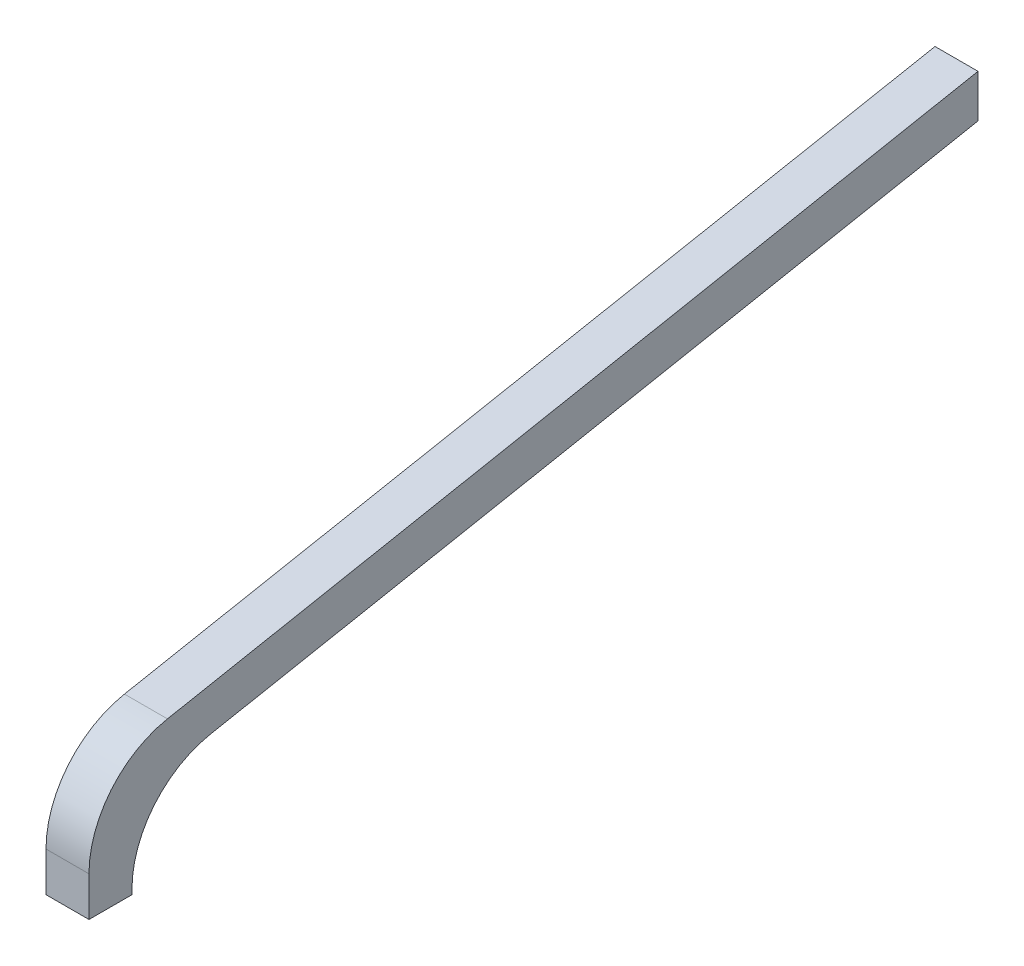
ISO-10303-21;
HEADER;
FILE_DESCRIPTION(('STEP AP214'),'2;1');
FILE_NAME('part.step','',(''),(''),'','','');
FILE_SCHEMA(('AUTOMOTIVE_DESIGN { 1 0 10303 214 1 1 1 1 }'));
ENDSEC;
DATA;
#1=APPLICATION_CONTEXT('core data for automotive mechanical design processes');
#2=APPLICATION_PROTOCOL_DEFINITION('international standard','automotive_design',2000,#1);
#3=PRODUCT_CONTEXT('',#1,'mechanical');
#4=PRODUCT('Part','Part','',(#3));
#5=PRODUCT_RELATED_PRODUCT_CATEGORY('part','',(#4));
#6=PRODUCT_DEFINITION_FORMATION('','',#4);
#7=PRODUCT_DEFINITION_CONTEXT('part definition',#1,'design');
#8=PRODUCT_DEFINITION('design','',#6,#7);
#9=PRODUCT_DEFINITION_SHAPE('','',#8);
#10=(LENGTH_UNIT() NAMED_UNIT(*) SI_UNIT(.MILLI.,.METRE.));
#11=(NAMED_UNIT(*) PLANE_ANGLE_UNIT() SI_UNIT($,.RADIAN.));
#12=(NAMED_UNIT(*) SI_UNIT($,.STERADIAN.) SOLID_ANGLE_UNIT());
#13=UNCERTAINTY_MEASURE_WITH_UNIT(LENGTH_MEASURE(1.E-05),#10,'distance_accuracy_value','');
#14=(GEOMETRIC_REPRESENTATION_CONTEXT(3) GLOBAL_UNCERTAINTY_ASSIGNED_CONTEXT((#13)) GLOBAL_UNIT_ASSIGNED_CONTEXT((#10,
#11,#12)) REPRESENTATION_CONTEXT('',''));
#15=CARTESIAN_POINT('',(0.,0.,0.));
#16=DIRECTION('',(0.,0.,1.));
#17=DIRECTION('',(1.,0.,0.));
#18=AXIS2_PLACEMENT_3D('',#15,#16,#17);
#19=CARTESIAN_POINT('',(-1.74625,-3.01580115473571,-2.8055));
#20=DIRECTION('',(1.,0.,0.));
#21=DIRECTION('',(0.,0.,-1.));
#22=AXIS2_PLACEMENT_3D('',#19,#20,#21);
#23=PLANE('',#22);
#24=DIRECTION('',(0.,-0.18846469104419,0.982079966311104));
#25=VECTOR('',#24,1.);
#26=CARTESIAN_POINT('',(-1.74625,-2.3929200336889,-3.06153530895581));
#27=LINE('',#26,#25);
#28=CARTESIAN_POINT('',(-1.74625,-0.869500000000001,-11.));
#29=VERTEX_POINT('',#28);
#30=CARTESIAN_POINT('',(-1.74625,-2.3929200336889,-3.06153530895581));
#31=VERTEX_POINT('',#30);
#32=EDGE_CURVE('E96',#29,#31,#27,.T.);
#33=ORIENTED_EDGE('',*,*,#32,.T.);
#34=CARTESIAN_POINT('',(-1.74625,-3.375,-3.25));
#35=DIRECTION('',(-1.,0.,0.));
#36=DIRECTION('',(0.,0.,1.));
#37=AXIS2_PLACEMENT_3D('',#34,#35,#36);
#38=CIRCLE('',#37,1.);
#39=CARTESIAN_POINT('',(-1.74625,-3.375,-2.25));
#40=VERTEX_POINT('',#39);
#41=EDGE_CURVE('E119',#31,#40,#38,.F.);
#42=ORIENTED_EDGE('',*,*,#41,.T.);
#43=DIRECTION('',(0.,1.,0.));
#44=VECTOR('',#43,1.);
#45=CARTESIAN_POINT('',(-1.74625,-3.425,-2.25));
#46=LINE('',#45,#44);
#47=CARTESIAN_POINT('',(-1.74625,-3.425,-2.25));
#48=VERTEX_POINT('',#47);
#49=EDGE_CURVE('E124',#40,#48,#46,.F.);
#50=ORIENTED_EDGE('',*,*,#49,.T.);
#51=DIRECTION('',(0.,0.,1.));
#52=VECTOR('',#51,1.);
#53=CARTESIAN_POINT('',(-1.74625,-3.425,-1.8055));
#54=LINE('',#53,#52);
#55=CARTESIAN_POINT('',(-1.74625,-3.425,-1.8055));
#56=VERTEX_POINT('',#55);
#57=EDGE_CURVE('E133',#48,#56,#54,.T.);
#58=ORIENTED_EDGE('',*,*,#57,.T.);
#59=DIRECTION('',(0.,1.,0.));
#60=VECTOR('',#59,1.);
#61=CARTESIAN_POINT('',(-1.74625,-3.01580115473571,-1.8055));
#62=LINE('',#61,#60);
#63=CARTESIAN_POINT('',(-1.74625,-3.01580115473571,-1.8055));
#64=VERTEX_POINT('',#63);
#65=EDGE_CURVE('E141',#56,#64,#62,.T.);
#66=ORIENTED_EDGE('',*,*,#65,.T.);
#67=CARTESIAN_POINT('',(-1.74625,-3.01580115473571,-2.8055));
#68=DIRECTION('',(-1.,0.,0.));
#69=DIRECTION('',(0.,0.,1.));
#70=AXIS2_PLACEMENT_3D('',#67,#68,#69);
#71=CIRCLE('',#70,1.);
#72=CARTESIAN_POINT('',(-1.74625,-2.03372118842461,-2.61703530895581));
#73=VERTEX_POINT('',#72);
#74=EDGE_CURVE('E20',#73,#64,#71,.F.);
#75=ORIENTED_EDGE('',*,*,#74,.F.);
#76=DIRECTION('',(0.,0.18846469104419,-0.982079966311104));
#77=VECTOR('',#76,1.);
#78=CARTESIAN_POINT('',(-1.74625,-0.425000000000001,-11.));
#79=LINE('',#78,#77);
#80=CARTESIAN_POINT('',(-1.74625,-0.425000000000001,-11.));
#81=VERTEX_POINT('',#80);
#82=EDGE_CURVE('E150',#73,#81,#79,.T.);
#83=ORIENTED_EDGE('',*,*,#82,.T.);
#84=DIRECTION('',(0.,1.,0.));
#85=VECTOR('',#84,1.);
#86=CARTESIAN_POINT('',(-1.74625,-0.869500000000001,-11.));
#87=LINE('',#86,#85);
#88=EDGE_CURVE('E70',#81,#29,#87,.F.);
#89=ORIENTED_EDGE('',*,*,#88,.T.);
#90=EDGE_LOOP('',(#33,#42,#50,#58,#66,#75,#83,#89));
#91=FACE_BOUND('',#90,.T.);
#92=ADVANCED_FACE('F17',(#91),#23,.F.);
#93=CARTESIAN_POINT('',(-1.30175,-0.869500000000001,-11.));
#94=DIRECTION('',(0.,0.,1.));
#95=DIRECTION('',(1.,0.,0.));
#96=AXIS2_PLACEMENT_3D('',#93,#94,#95);
#97=PLANE('',#96);
#98=DIRECTION('',(1.,0.,0.));
#99=VECTOR('',#98,1.);
#100=CARTESIAN_POINT('',(-1.30175,-0.425000000000001,-11.));
#101=LINE('',#100,#99);
#102=CARTESIAN_POINT('',(-1.30175,-0.425000000000001,-11.));
#103=VERTEX_POINT('',#102);
#104=EDGE_CURVE('E91',#81,#103,#101,.T.);
#105=ORIENTED_EDGE('',*,*,#104,.T.);
#106=DIRECTION('',(0.,1.,0.));
#107=VECTOR('',#106,1.);
#108=CARTESIAN_POINT('',(-1.30175,-3.01580115473571,-11.));
#109=LINE('',#108,#107);
#110=CARTESIAN_POINT('',(-1.30175,-0.869500000000001,-11.));
#111=VERTEX_POINT('',#110);
#112=EDGE_CURVE('E85',#111,#103,#109,.T.);
#113=ORIENTED_EDGE('',*,*,#112,.F.);
#114=DIRECTION('',(1.,0.,0.));
#115=VECTOR('',#114,1.);
#116=CARTESIAN_POINT('',(-1.30175,-0.869500000000001,-11.));
#117=LINE('',#116,#115);
#118=EDGE_CURVE('E88',#111,#29,#117,.F.);
#119=ORIENTED_EDGE('',*,*,#118,.T.);
#120=ORIENTED_EDGE('',*,*,#88,.F.);
#121=EDGE_LOOP('',(#105,#113,#119,#120));
#122=FACE_BOUND('',#121,.T.);
#123=ADVANCED_FACE('F87',(#122),#97,.F.);
#124=CARTESIAN_POINT('',(-1.30175,-0.425000000000001,-11.));
#125=DIRECTION('',(0.,-0.982079966311104,-0.18846469104419));
#126=DIRECTION('',(0.,0.18846469104419,-0.982079966311104));
#127=AXIS2_PLACEMENT_3D('',#124,#125,#126);
#128=PLANE('',#127);
#129=DIRECTION('',(-1.,0.,0.));
#130=VECTOR('',#129,1.);
#131=CARTESIAN_POINT('',(-1.30175,-2.03372118842461,-2.61703530895581));
#132=LINE('',#131,#130);
#133=CARTESIAN_POINT('',(-1.30175,-2.03372118842461,-2.61703530895581));
#134=VERTEX_POINT('',#133);
#135=EDGE_CURVE('E146',#134,#73,#132,.T.);
#136=ORIENTED_EDGE('',*,*,#135,.F.);
#137=DIRECTION('',(0.,-0.18846469104419,0.982079966311103));
#138=VECTOR('',#137,1.);
#139=CARTESIAN_POINT('',(-1.30175,-0.425000000000001,-11.));
#140=LINE('',#139,#138);
#141=EDGE_CURVE('E95',#103,#134,#140,.T.);
#142=ORIENTED_EDGE('',*,*,#141,.F.);
#143=ORIENTED_EDGE('',*,*,#104,.F.);
#144=ORIENTED_EDGE('',*,*,#82,.F.);
#145=EDGE_LOOP('',(#136,#142,#143,#144));
#146=FACE_BOUND('',#145,.T.);
#147=ADVANCED_FACE('F190',(#146),#128,.F.);
#148=CARTESIAN_POINT('',(-1.30175,-3.01580115473571,-2.8055));
#149=DIRECTION('',(-1.,0.,0.));
#150=DIRECTION('',(0.,0.,1.));
#151=AXIS2_PLACEMENT_3D('',#148,#149,#150);
#152=CYLINDRICAL_SURFACE('',#151,1.);
#153=CARTESIAN_POINT('',(-1.30175,-3.01580115473571,-2.8055));
#154=DIRECTION('',(-1.,0.,0.));
#155=DIRECTION('',(0.,0.,1.));
#156=AXIS2_PLACEMENT_3D('',#153,#154,#155);
#157=CIRCLE('',#156,1.);
#158=CARTESIAN_POINT('',(-1.30175,-3.01580115473571,-1.8055));
#159=VERTEX_POINT('',#158);
#160=EDGE_CURVE('E116',#134,#159,#157,.F.);
#161=ORIENTED_EDGE('',*,*,#160,.F.);
#162=ORIENTED_EDGE('',*,*,#135,.T.);
#163=ORIENTED_EDGE('',*,*,#74,.T.);
#164=DIRECTION('',(-1.,0.,0.));
#165=VECTOR('',#164,1.);
#166=CARTESIAN_POINT('',(-1.30175,-3.01580115473571,-1.8055));
#167=LINE('',#166,#165);
#168=EDGE_CURVE('E144',#64,#159,#167,.F.);
#169=ORIENTED_EDGE('',*,*,#168,.T.);
#170=EDGE_LOOP('',(#161,#162,#163,#169));
#171=FACE_BOUND('',#170,.T.);
#172=ADVANCED_FACE('F169',(#171),#152,.T.);
#173=CARTESIAN_POINT('',(-1.30175,-3.01580115473571,-1.8055));
#174=DIRECTION('',(0.,0.,-1.));
#175=DIRECTION('',(-1.,0.,0.));
#176=AXIS2_PLACEMENT_3D('',#173,#174,#175);
#177=PLANE('',#176);
#178=DIRECTION('',(1.,0.,0.));
#179=VECTOR('',#178,1.);
#180=CARTESIAN_POINT('',(-1.30175,-3.425,-1.8055));
#181=LINE('',#180,#179);
#182=CARTESIAN_POINT('',(-1.30175,-3.425,-1.8055));
#183=VERTEX_POINT('',#182);
#184=EDGE_CURVE('E139',#56,#183,#181,.T.);
#185=ORIENTED_EDGE('',*,*,#184,.T.);
#186=DIRECTION('',(0.,1.,0.));
#187=VECTOR('',#186,1.);
#188=CARTESIAN_POINT('',(-1.30175,-3.01580115473571,-1.8055));
#189=LINE('',#188,#187);
#190=EDGE_CURVE('E118',#159,#183,#189,.F.);
#191=ORIENTED_EDGE('',*,*,#190,.F.);
#192=ORIENTED_EDGE('',*,*,#168,.F.);
#193=ORIENTED_EDGE('',*,*,#65,.F.);
#194=EDGE_LOOP('',(#185,#191,#192,#193));
#195=FACE_BOUND('',#194,.T.);
#196=ADVANCED_FACE('F174',(#195),#177,.F.);
#197=CARTESIAN_POINT('',(-1.30175,-3.425,-1.8055));
#198=DIRECTION('',(0.,1.,0.));
#199=DIRECTION('',(0.,0.,1.));
#200=AXIS2_PLACEMENT_3D('',#197,#198,#199);
#201=PLANE('',#200);
#202=DIRECTION('',(1.,0.,0.));
#203=VECTOR('',#202,1.);
#204=CARTESIAN_POINT('',(-1.30175,-3.425,-2.25));
#205=LINE('',#204,#203);
#206=CARTESIAN_POINT('',(-1.30175,-3.425,-2.25));
#207=VERTEX_POINT('',#206);
#208=EDGE_CURVE('E127',#48,#207,#205,.T.);
#209=ORIENTED_EDGE('',*,*,#208,.T.);
#210=DIRECTION('',(0.,0.,-1.));
#211=VECTOR('',#210,1.);
#212=CARTESIAN_POINT('',(-1.30175,-3.425,-2.8055));
#213=LINE('',#212,#211);
#214=EDGE_CURVE('E110',#183,#207,#213,.T.);
#215=ORIENTED_EDGE('',*,*,#214,.F.);
#216=ORIENTED_EDGE('',*,*,#184,.F.);
#217=ORIENTED_EDGE('',*,*,#57,.F.);
#218=EDGE_LOOP('',(#209,#215,#216,#217));
#219=FACE_BOUND('',#218,.T.);
#220=ADVANCED_FACE('F212',(#219),#201,.F.);
#221=CARTESIAN_POINT('',(-1.30175,-3.425,-2.25));
#222=DIRECTION('',(0.,0.,1.));
#223=DIRECTION('',(1.,0.,0.));
#224=AXIS2_PLACEMENT_3D('',#221,#222,#223);
#225=PLANE('',#224);
#226=DIRECTION('',(-1.,0.,0.));
#227=VECTOR('',#226,1.);
#228=CARTESIAN_POINT('',(-1.30175,-3.375,-2.25));
#229=LINE('',#228,#227);
#230=CARTESIAN_POINT('',(-1.30175,-3.375,-2.25));
#231=VERTEX_POINT('',#230);
#232=EDGE_CURVE('E121',#40,#231,#229,.F.);
#233=ORIENTED_EDGE('',*,*,#232,.T.);
#234=DIRECTION('',(0.,1.,0.));
#235=VECTOR('',#234,1.);
#236=CARTESIAN_POINT('',(-1.30175,-3.01580115473571,-2.25));
#237=LINE('',#236,#235);
#238=EDGE_CURVE('E107',#207,#231,#237,.T.);
#239=ORIENTED_EDGE('',*,*,#238,.F.);
#240=ORIENTED_EDGE('',*,*,#208,.F.);
#241=ORIENTED_EDGE('',*,*,#49,.F.);
#242=EDGE_LOOP('',(#233,#239,#240,#241));
#243=FACE_BOUND('',#242,.T.);
#244=ADVANCED_FACE('F209',(#243),#225,.F.);
#245=CARTESIAN_POINT('',(-1.30175,-3.375,-3.25));
#246=DIRECTION('',(-1.,0.,0.));
#247=DIRECTION('',(0.,0.,1.));
#248=AXIS2_PLACEMENT_3D('',#245,#246,#247);
#249=CYLINDRICAL_SURFACE('',#248,1.);
#250=DIRECTION('',(1.,0.,0.));
#251=VECTOR('',#250,1.);
#252=CARTESIAN_POINT('',(-1.30175,-2.3929200336889,-3.06153530895581));
#253=LINE('',#252,#251);
#254=CARTESIAN_POINT('',(-1.30175,-2.3929200336889,-3.06153530895581));
#255=VERTEX_POINT('',#254);
#256=EDGE_CURVE('E35',#31,#255,#253,.T.);
#257=ORIENTED_EDGE('',*,*,#256,.T.);
#258=CARTESIAN_POINT('',(-1.30175,-3.375,-3.25));
#259=DIRECTION('',(-1.,0.,0.));
#260=DIRECTION('',(0.,0.,1.));
#261=AXIS2_PLACEMENT_3D('',#258,#259,#260);
#262=CIRCLE('',#261,1.);
#263=EDGE_CURVE('E26',#231,#255,#262,.T.);
#264=ORIENTED_EDGE('',*,*,#263,.F.);
#265=ORIENTED_EDGE('',*,*,#232,.F.);
#266=ORIENTED_EDGE('',*,*,#41,.F.);
#267=EDGE_LOOP('',(#257,#264,#265,#266));
#268=FACE_BOUND('',#267,.T.);
#269=ADVANCED_FACE('F204',(#268),#249,.F.);
#270=CARTESIAN_POINT('',(-1.30175,-2.3929200336889,-3.06153530895581));
#271=DIRECTION('',(0.,0.982079966311104,0.18846469104419));
#272=DIRECTION('',(0.,-0.18846469104419,0.982079966311104));
#273=AXIS2_PLACEMENT_3D('',#270,#271,#272);
#274=PLANE('',#273);
#275=ORIENTED_EDGE('',*,*,#118,.F.);
#276=DIRECTION('',(0.,0.18846469104419,-0.982079966311103));
#277=VECTOR('',#276,1.);
#278=CARTESIAN_POINT('',(-1.30175,-2.3929200336889,-3.06153530895581));
#279=LINE('',#278,#277);
#280=EDGE_CURVE('E11',#255,#111,#279,.T.);
#281=ORIENTED_EDGE('',*,*,#280,.F.);
#282=ORIENTED_EDGE('',*,*,#256,.F.);
#283=ORIENTED_EDGE('',*,*,#32,.F.);
#284=EDGE_LOOP('',(#275,#281,#282,#283));
#285=FACE_BOUND('',#284,.T.);
#286=ADVANCED_FACE('F99',(#285),#274,.F.);
#287=CARTESIAN_POINT('',(-1.30175,-3.01580115473571,-2.8055));
#288=DIRECTION('',(1.,0.,0.));
#289=DIRECTION('',(0.,0.,-1.));
#290=AXIS2_PLACEMENT_3D('',#287,#288,#289);
#291=PLANE('',#290);
#292=ORIENTED_EDGE('',*,*,#263,.T.);
#293=ORIENTED_EDGE('',*,*,#280,.T.);
#294=ORIENTED_EDGE('',*,*,#112,.T.);
#295=ORIENTED_EDGE('',*,*,#141,.T.);
#296=ORIENTED_EDGE('',*,*,#160,.T.);
#297=ORIENTED_EDGE('',*,*,#190,.T.);
#298=ORIENTED_EDGE('',*,*,#214,.T.);
#299=ORIENTED_EDGE('',*,*,#238,.T.);
#300=EDGE_LOOP('',(#292,#293,#294,#295,#296,#297,#298,#299));
#301=FACE_BOUND('',#300,.T.);
#302=ADVANCED_FACE('F103',(#301),#291,.T.);
#303=CLOSED_SHELL('',(#92,#123,#147,#172,#196,#220,#244,#269,#286,#302));
#304=MANIFOLD_SOLID_BREP('B1',#303);
#305=ADVANCED_BREP_SHAPE_REPRESENTATION('',(#18,#304),#14);
#306=SHAPE_DEFINITION_REPRESENTATION(#9,#305);
ENDSEC;
END-ISO-10303-21;
